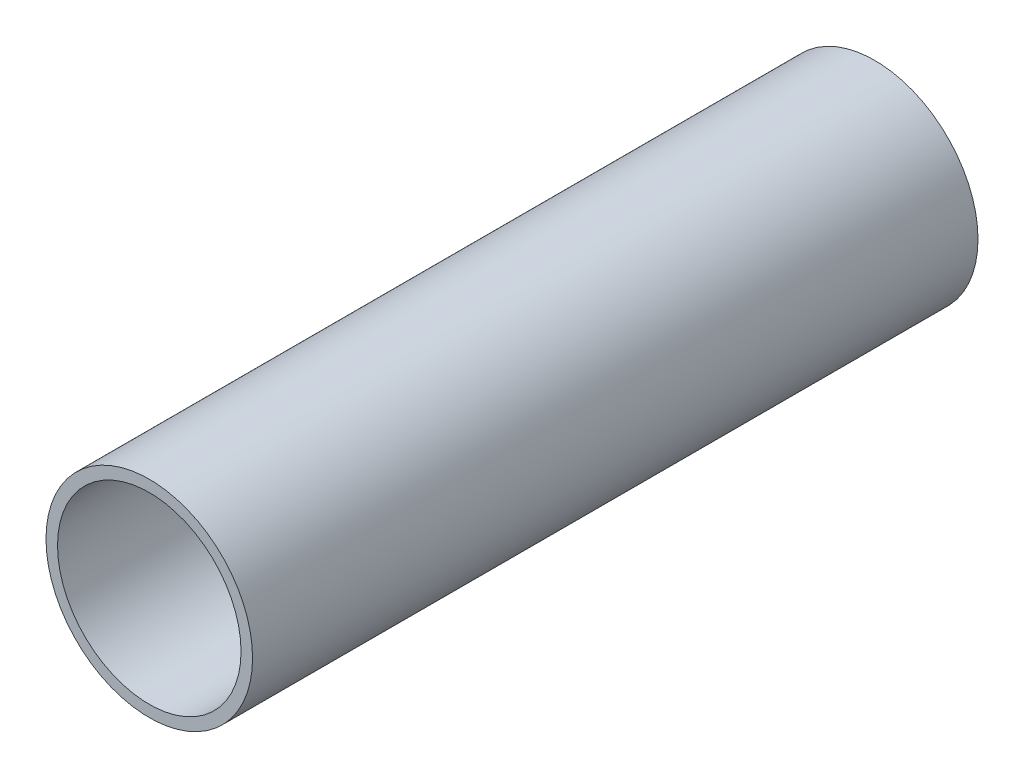
ISO-10303-21;
HEADER;
FILE_DESCRIPTION(('STEP AP214'),'2;1');
FILE_NAME('part.step','',(''),(''),'','','');
FILE_SCHEMA(('AUTOMOTIVE_DESIGN { 1 0 10303 214 1 1 1 1 }'));
ENDSEC;
DATA;
#1=APPLICATION_CONTEXT('core data for automotive mechanical design processes');
#2=APPLICATION_PROTOCOL_DEFINITION('international standard','automotive_design',2000,#1);
#3=PRODUCT_CONTEXT('',#1,'mechanical');
#4=PRODUCT('Part','Part','',(#3));
#5=PRODUCT_RELATED_PRODUCT_CATEGORY('part','',(#4));
#6=PRODUCT_DEFINITION_FORMATION('','',#4);
#7=PRODUCT_DEFINITION_CONTEXT('part definition',#1,'design');
#8=PRODUCT_DEFINITION('design','',#6,#7);
#9=PRODUCT_DEFINITION_SHAPE('','',#8);
#10=(LENGTH_UNIT() NAMED_UNIT(*) SI_UNIT(.MILLI.,.METRE.));
#11=(NAMED_UNIT(*) PLANE_ANGLE_UNIT() SI_UNIT($,.RADIAN.));
#12=(NAMED_UNIT(*) SI_UNIT($,.STERADIAN.) SOLID_ANGLE_UNIT());
#13=UNCERTAINTY_MEASURE_WITH_UNIT(LENGTH_MEASURE(1.E-05),#10,'distance_accuracy_value','');
#14=(GEOMETRIC_REPRESENTATION_CONTEXT(3) GLOBAL_UNCERTAINTY_ASSIGNED_CONTEXT((#13)) GLOBAL_UNIT_ASSIGNED_CONTEXT((#10,
#11,#12)) REPRESENTATION_CONTEXT('',''));
#15=CARTESIAN_POINT('',(0.,0.,0.));
#16=DIRECTION('',(0.,0.,1.));
#17=DIRECTION('',(1.,0.,0.));
#18=AXIS2_PLACEMENT_3D('',#15,#16,#17);
#19=CARTESIAN_POINT('',(0.,0.,400.));
#20=DIRECTION('',(0.,0.,1.));
#21=DIRECTION('',(1.,0.,0.));
#22=AXIS2_PLACEMENT_3D('',#19,#20,#21);
#23=PLANE('',#22);
#24=CARTESIAN_POINT('',(0.,0.,400.));
#25=DIRECTION('',(0.,0.,1.));
#26=DIRECTION('',(1.,0.,0.));
#27=AXIS2_PLACEMENT_3D('',#24,#25,#26);
#28=CIRCLE('',#27,56.945);
#29=CARTESIAN_POINT('',(56.945,0.,400.));
#30=VERTEX_POINT('',#29);
#31=EDGE_CURVE('E10',#30,#30,#28,.T.);
#32=ORIENTED_EDGE('',*,*,#31,.T.);
#33=EDGE_LOOP('',(#32));
#34=FACE_BOUND('',#33,.T.);
#35=CARTESIAN_POINT('',(0.,0.,400.));
#36=DIRECTION('',(0.,0.,1.));
#37=DIRECTION('',(1.,0.,0.));
#38=AXIS2_PLACEMENT_3D('',#35,#36,#37);
#39=CIRCLE('',#38,50.595);
#40=CARTESIAN_POINT('',(50.595,0.,400.));
#41=VERTEX_POINT('',#40);
#42=EDGE_CURVE('E46',#41,#41,#39,.T.);
#43=ORIENTED_EDGE('',*,*,#42,.F.);
#44=EDGE_LOOP('',(#43));
#45=FACE_BOUND('',#44,.T.);
#46=ADVANCED_FACE('F35',(#34,#45),#23,.T.);
#47=CARTESIAN_POINT('',(0.,0.,0.));
#48=DIRECTION('',(0.,0.,1.));
#49=DIRECTION('',(1.,0.,0.));
#50=AXIS2_PLACEMENT_3D('',#47,#48,#49);
#51=PLANE('',#50);
#52=CARTESIAN_POINT('',(0.,0.,0.));
#53=DIRECTION('',(0.,0.,1.));
#54=DIRECTION('',(1.,0.,0.));
#55=AXIS2_PLACEMENT_3D('',#52,#53,#54);
#56=CIRCLE('',#55,56.945);
#57=CARTESIAN_POINT('',(56.945,0.,0.));
#58=VERTEX_POINT('',#57);
#59=EDGE_CURVE('E39',#58,#58,#56,.T.);
#60=ORIENTED_EDGE('',*,*,#59,.F.);
#61=EDGE_LOOP('',(#60));
#62=FACE_BOUND('',#61,.T.);
#63=CARTESIAN_POINT('',(0.,0.,0.));
#64=DIRECTION('',(0.,0.,1.));
#65=DIRECTION('',(1.,0.,0.));
#66=AXIS2_PLACEMENT_3D('',#63,#64,#65);
#67=CIRCLE('',#66,50.595);
#68=CARTESIAN_POINT('',(50.595,0.,0.));
#69=VERTEX_POINT('',#68);
#70=EDGE_CURVE('E48',#69,#69,#67,.T.);
#71=ORIENTED_EDGE('',*,*,#70,.T.);
#72=EDGE_LOOP('',(#71));
#73=FACE_BOUND('',#72,.T.);
#74=ADVANCED_FACE('F58',(#62,#73),#51,.F.);
#75=CARTESIAN_POINT('',(0.,0.,400.));
#76=DIRECTION('',(0.,0.,-1.));
#77=DIRECTION('',(-1.,0.,0.));
#78=AXIS2_PLACEMENT_3D('',#75,#76,#77);
#79=CYLINDRICAL_SURFACE('',#78,56.945);
#80=ORIENTED_EDGE('',*,*,#31,.F.);
#81=EDGE_LOOP('',(#80));
#82=FACE_BOUND('',#81,.T.);
#83=ORIENTED_EDGE('',*,*,#59,.T.);
#84=EDGE_LOOP('',(#83));
#85=FACE_BOUND('',#84,.T.);
#86=ADVANCED_FACE('F37',(#82,#85),#79,.T.);
#87=CARTESIAN_POINT('',(0.,0.,400.));
#88=DIRECTION('',(0.,0.,-1.));
#89=DIRECTION('',(-1.,0.,0.));
#90=AXIS2_PLACEMENT_3D('',#87,#88,#89);
#91=CYLINDRICAL_SURFACE('',#90,50.595);
#92=ORIENTED_EDGE('',*,*,#42,.T.);
#93=EDGE_LOOP('',(#92));
#94=FACE_BOUND('',#93,.T.);
#95=ORIENTED_EDGE('',*,*,#70,.F.);
#96=EDGE_LOOP('',(#95));
#97=FACE_BOUND('',#96,.T.);
#98=ADVANCED_FACE('F54',(#94,#97),#91,.F.);
#99=CLOSED_SHELL('',(#46,#74,#86,#98));
#100=MANIFOLD_SOLID_BREP('B2',#99);
#101=ADVANCED_BREP_SHAPE_REPRESENTATION('',(#18,#100),#14);
#102=SHAPE_DEFINITION_REPRESENTATION(#9,#101);
ENDSEC;
END-ISO-10303-21;
